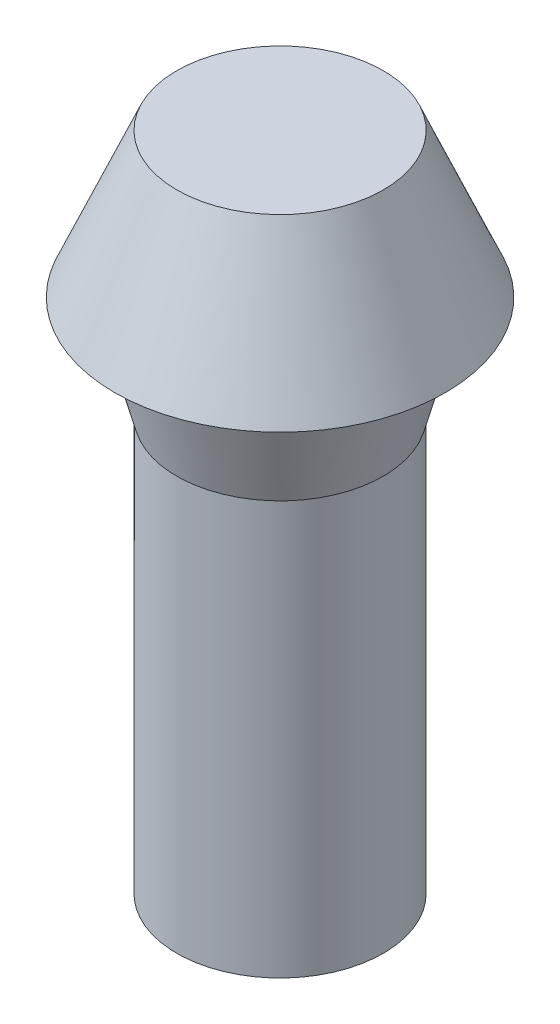
ISO-10303-21;
HEADER;
FILE_DESCRIPTION(('STEP AP214'),'2;1');
FILE_NAME('part.step','',(''),(''),'','','');
FILE_SCHEMA(('AUTOMOTIVE_DESIGN { 1 0 10303 214 1 1 1 1 }'));
ENDSEC;
DATA;
#1=APPLICATION_CONTEXT('core data for automotive mechanical design processes');
#2=APPLICATION_PROTOCOL_DEFINITION('international standard','automotive_design',2000,#1);
#3=PRODUCT_CONTEXT('',#1,'mechanical');
#4=PRODUCT('Part','Part','',(#3));
#5=PRODUCT_RELATED_PRODUCT_CATEGORY('part','',(#4));
#6=PRODUCT_DEFINITION_FORMATION('','',#4);
#7=PRODUCT_DEFINITION_CONTEXT('part definition',#1,'design');
#8=PRODUCT_DEFINITION('design','',#6,#7);
#9=PRODUCT_DEFINITION_SHAPE('','',#8);
#10=(LENGTH_UNIT() NAMED_UNIT(*) SI_UNIT(.MILLI.,.METRE.));
#11=(NAMED_UNIT(*) PLANE_ANGLE_UNIT() SI_UNIT($,.RADIAN.));
#12=(NAMED_UNIT(*) SI_UNIT($,.STERADIAN.) SOLID_ANGLE_UNIT());
#13=UNCERTAINTY_MEASURE_WITH_UNIT(LENGTH_MEASURE(1.E-05),#10,'distance_accuracy_value','');
#14=(GEOMETRIC_REPRESENTATION_CONTEXT(3) GLOBAL_UNCERTAINTY_ASSIGNED_CONTEXT((#13)) GLOBAL_UNIT_ASSIGNED_CONTEXT((#10,
#11,#12)) REPRESENTATION_CONTEXT('',''));
#15=CARTESIAN_POINT('',(0.,0.,0.));
#16=DIRECTION('',(0.,0.,1.));
#17=DIRECTION('',(1.,0.,0.));
#18=AXIS2_PLACEMENT_3D('',#15,#16,#17);
#19=CARTESIAN_POINT('',(0.,0.,0.));
#20=DIRECTION('',(0.,1.,0.));
#21=DIRECTION('',(0.,0.,1.));
#22=AXIS2_PLACEMENT_3D('',#19,#20,#21);
#23=PLANE('',#22);
#24=CARTESIAN_POINT('',(0.,0.,0.));
#25=DIRECTION('',(0.,-1.,0.));
#26=DIRECTION('',(0.,0.,-1.));
#27=AXIS2_PLACEMENT_3D('',#24,#25,#26);
#28=CIRCLE('',#27,6.33974596215562);
#29=CARTESIAN_POINT('',(0.,0.,-6.33974596215562));
#30=VERTEX_POINT('',#29);
#31=EDGE_CURVE('E47',#30,#30,#28,.T.);
#32=ORIENTED_EDGE('',*,*,#31,.F.);
#33=EDGE_LOOP('',(#32));
#34=FACE_BOUND('',#33,.T.);
#35=CARTESIAN_POINT('',(0.,0.,0.));
#36=DIRECTION('',(0.,1.,0.));
#37=DIRECTION('',(0.,0.,1.));
#38=AXIS2_PLACEMENT_3D('',#35,#36,#37);
#39=CIRCLE('',#38,8.);
#40=CARTESIAN_POINT('',(0.,0.,8.));
#41=VERTEX_POINT('',#40);
#42=EDGE_CURVE('E41',#41,#41,#39,.T.);
#43=ORIENTED_EDGE('',*,*,#42,.F.);
#44=EDGE_LOOP('',(#43));
#45=FACE_BOUND('',#44,.T.);
#46=ADVANCED_FACE('F33',(#34,#45),#23,.F.);
#47=CARTESIAN_POINT('',(0.,7.,0.));
#48=DIRECTION('',(0.,1.,0.));
#49=DIRECTION('',(0.,0.,1.));
#50=AXIS2_PLACEMENT_3D('',#47,#48,#49);
#51=PLANE('',#50);
#52=CARTESIAN_POINT('',(0.,7.,0.));
#53=DIRECTION('',(0.,1.,0.));
#54=DIRECTION('',(0.,0.,1.));
#55=AXIS2_PLACEMENT_3D('',#52,#53,#54);
#56=CIRCLE('',#55,5.);
#57=CARTESIAN_POINT('',(0.,7.,5.));
#58=VERTEX_POINT('',#57);
#59=EDGE_CURVE('E11',#58,#58,#56,.T.);
#60=ORIENTED_EDGE('',*,*,#59,.T.);
#61=EDGE_LOOP('',(#60));
#62=FACE_BOUND('',#61,.T.);
#63=ADVANCED_FACE('F83',(#62),#51,.T.);
#64=CARTESIAN_POINT('',(0.,7.,0.));
#65=DIRECTION('',(0.,-1.,0.));
#66=DIRECTION('',(0.,0.,-1.));
#67=AXIS2_PLACEMENT_3D('',#64,#65,#66);
#68=CONICAL_SURFACE('',#67,5.,0.404891786285083);
#69=ORIENTED_EDGE('',*,*,#59,.F.);
#70=EDGE_LOOP('',(#69));
#71=FACE_BOUND('',#70,.T.);
#72=ORIENTED_EDGE('',*,*,#42,.T.);
#73=EDGE_LOOP('',(#72));
#74=FACE_BOUND('',#73,.T.);
#75=ADVANCED_FACE('F67',(#71,#74),#68,.T.);
#76=CARTESIAN_POINT('',(0.,-5.,0.));
#77=DIRECTION('',(0.,1.,0.));
#78=DIRECTION('',(0.,0.,-1.));
#79=AXIS2_PLACEMENT_3D('',#76,#77,#78);
#80=CONICAL_SURFACE('',#79,5.,0.26179938779915);
#81=ORIENTED_EDGE('',*,*,#31,.T.);
#82=EDGE_LOOP('',(#81));
#83=FACE_BOUND('',#82,.T.);
#84=CARTESIAN_POINT('',(0.,-5.,0.));
#85=DIRECTION('',(0.,-1.,0.));
#86=DIRECTION('',(0.,0.,-1.));
#87=AXIS2_PLACEMENT_3D('',#84,#85,#86);
#88=CIRCLE('',#87,5.);
#89=CARTESIAN_POINT('',(0.,-5.,-5.));
#90=VERTEX_POINT('',#89);
#91=EDGE_CURVE('E108',#90,#90,#88,.T.);
#92=ORIENTED_EDGE('',*,*,#91,.F.);
#93=EDGE_LOOP('',(#92));
#94=FACE_BOUND('',#93,.T.);
#95=ADVANCED_FACE('F82',(#83,#94),#80,.T.);
#96=CARTESIAN_POINT('',(0.,-25.,0.));
#97=DIRECTION('',(0.,1.,0.));
#98=DIRECTION('',(0.,0.,1.));
#99=AXIS2_PLACEMENT_3D('',#96,#97,#98);
#100=CYLINDRICAL_SURFACE('',#99,5.);
#101=CARTESIAN_POINT('',(0.,-25.,0.));
#102=DIRECTION('',(0.,-1.,0.));
#103=DIRECTION('',(0.,0.,-1.));
#104=AXIS2_PLACEMENT_3D('',#101,#102,#103);
#105=CIRCLE('',#104,5.);
#106=CARTESIAN_POINT('',(0.,-25.,-5.));
#107=VERTEX_POINT('',#106);
#108=EDGE_CURVE('E111',#107,#107,#105,.T.);
#109=ORIENTED_EDGE('',*,*,#108,.F.);
#110=EDGE_LOOP('',(#109));
#111=FACE_BOUND('',#110,.T.);
#112=ORIENTED_EDGE('',*,*,#91,.T.);
#113=EDGE_LOOP('',(#112));
#114=FACE_BOUND('',#113,.T.);
#115=ADVANCED_FACE('F91',(#111,#114),#100,.T.);
#116=CARTESIAN_POINT('',(0.,-25.,0.));
#117=DIRECTION('',(0.,-1.,0.));
#118=DIRECTION('',(0.,0.,-1.));
#119=AXIS2_PLACEMENT_3D('',#116,#117,#118);
#120=PLANE('',#119);
#121=ORIENTED_EDGE('',*,*,#108,.T.);
#122=EDGE_LOOP('',(#121));
#123=FACE_BOUND('',#122,.T.);
#124=ADVANCED_FACE('F95',(#123),#120,.T.);
#125=CLOSED_SHELL('',(#46,#63,#75,#95,#115,#124));
#126=MANIFOLD_SOLID_BREP('B2',#125);
#127=ADVANCED_BREP_SHAPE_REPRESENTATION('',(#18,#126),#14);
#128=SHAPE_DEFINITION_REPRESENTATION(#9,#127);
ENDSEC;
END-ISO-10303-21;
